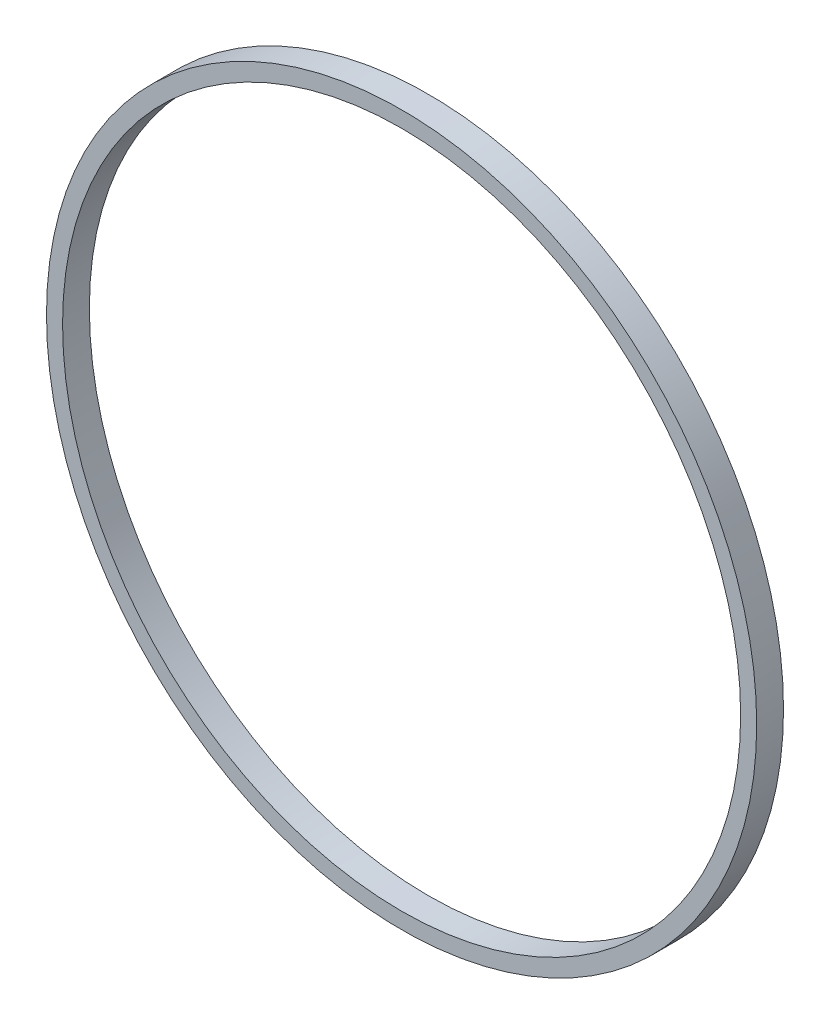
ISO-10303-21;
HEADER;
FILE_DESCRIPTION(('STEP AP214'),'2;1');
FILE_NAME('part.step','',(''),(''),'','','');
FILE_SCHEMA(('AUTOMOTIVE_DESIGN { 1 0 10303 214 1 1 1 1 }'));
ENDSEC;
DATA;
#1=APPLICATION_CONTEXT('core data for automotive mechanical design processes');
#2=APPLICATION_PROTOCOL_DEFINITION('international standard','automotive_design',2000,#1);
#3=PRODUCT_CONTEXT('',#1,'mechanical');
#4=PRODUCT('Part','Part','',(#3));
#5=PRODUCT_RELATED_PRODUCT_CATEGORY('part','',(#4));
#6=PRODUCT_DEFINITION_FORMATION('','',#4);
#7=PRODUCT_DEFINITION_CONTEXT('part definition',#1,'design');
#8=PRODUCT_DEFINITION('design','',#6,#7);
#9=PRODUCT_DEFINITION_SHAPE('','',#8);
#10=(LENGTH_UNIT() NAMED_UNIT(*) SI_UNIT(.MILLI.,.METRE.));
#11=(NAMED_UNIT(*) PLANE_ANGLE_UNIT() SI_UNIT($,.RADIAN.));
#12=(NAMED_UNIT(*) SI_UNIT($,.STERADIAN.) SOLID_ANGLE_UNIT());
#13=UNCERTAINTY_MEASURE_WITH_UNIT(LENGTH_MEASURE(1.E-05),#10,'distance_accuracy_value','');
#14=(GEOMETRIC_REPRESENTATION_CONTEXT(3) GLOBAL_UNCERTAINTY_ASSIGNED_CONTEXT((#13)) GLOBAL_UNIT_ASSIGNED_CONTEXT((#10,
#11,#12)) REPRESENTATION_CONTEXT('',''));
#15=CARTESIAN_POINT('',(0.,0.,0.));
#16=DIRECTION('',(0.,0.,1.));
#17=DIRECTION('',(1.,0.,0.));
#18=AXIS2_PLACEMENT_3D('',#15,#16,#17);
#19=CARTESIAN_POINT('',(0.,0.,5.));
#20=DIRECTION('',(0.,0.,1.));
#21=DIRECTION('',(1.,0.,0.));
#22=AXIS2_PLACEMENT_3D('',#19,#20,#21);
#23=PLANE('',#22);
#24=CARTESIAN_POINT('',(0.,0.,5.));
#25=DIRECTION('',(0.,0.,1.));
#26=DIRECTION('',(1.,0.,0.));
#27=AXIS2_PLACEMENT_3D('',#24,#25,#26);
#28=CIRCLE('',#27,66.25);
#29=CARTESIAN_POINT('',(66.25,0.,5.));
#30=VERTEX_POINT('',#29);
#31=EDGE_CURVE('E10',#30,#30,#28,.T.);
#32=ORIENTED_EDGE('',*,*,#31,.T.);
#33=EDGE_LOOP('',(#32));
#34=FACE_BOUND('',#33,.T.);
#35=CARTESIAN_POINT('',(0.,0.,5.));
#36=DIRECTION('',(0.,0.,1.));
#37=DIRECTION('',(1.,0.,0.));
#38=AXIS2_PLACEMENT_3D('',#35,#36,#37);
#39=CIRCLE('',#38,63.25);
#40=CARTESIAN_POINT('',(63.25,0.,5.));
#41=VERTEX_POINT('',#40);
#42=EDGE_CURVE('E42',#41,#41,#39,.T.);
#43=ORIENTED_EDGE('',*,*,#42,.F.);
#44=EDGE_LOOP('',(#43));
#45=FACE_BOUND('',#44,.T.);
#46=ADVANCED_FACE('F31',(#34,#45),#23,.T.);
#47=CARTESIAN_POINT('',(0.,0.,0.));
#48=DIRECTION('',(0.,0.,1.));
#49=DIRECTION('',(1.,0.,0.));
#50=AXIS2_PLACEMENT_3D('',#47,#48,#49);
#51=PLANE('',#50);
#52=CARTESIAN_POINT('',(0.,0.,0.));
#53=DIRECTION('',(0.,0.,1.));
#54=DIRECTION('',(1.,0.,0.));
#55=AXIS2_PLACEMENT_3D('',#52,#53,#54);
#56=CIRCLE('',#55,66.25);
#57=CARTESIAN_POINT('',(66.25,0.,0.));
#58=VERTEX_POINT('',#57);
#59=EDGE_CURVE('E35',#58,#58,#56,.T.);
#60=ORIENTED_EDGE('',*,*,#59,.F.);
#61=EDGE_LOOP('',(#60));
#62=FACE_BOUND('',#61,.T.);
#63=CARTESIAN_POINT('',(0.,0.,0.));
#64=DIRECTION('',(0.,0.,1.));
#65=DIRECTION('',(1.,0.,0.));
#66=AXIS2_PLACEMENT_3D('',#63,#64,#65);
#67=CIRCLE('',#66,63.25);
#68=CARTESIAN_POINT('',(63.25,0.,0.));
#69=VERTEX_POINT('',#68);
#70=EDGE_CURVE('E44',#69,#69,#67,.T.);
#71=ORIENTED_EDGE('',*,*,#70,.T.);
#72=EDGE_LOOP('',(#71));
#73=FACE_BOUND('',#72,.T.);
#74=ADVANCED_FACE('F54',(#62,#73),#51,.F.);
#75=CARTESIAN_POINT('',(0.,0.,5.));
#76=DIRECTION('',(0.,0.,-1.));
#77=DIRECTION('',(-1.,0.,0.));
#78=AXIS2_PLACEMENT_3D('',#75,#76,#77);
#79=CYLINDRICAL_SURFACE('',#78,66.25);
#80=ORIENTED_EDGE('',*,*,#31,.F.);
#81=EDGE_LOOP('',(#80));
#82=FACE_BOUND('',#81,.T.);
#83=ORIENTED_EDGE('',*,*,#59,.T.);
#84=EDGE_LOOP('',(#83));
#85=FACE_BOUND('',#84,.T.);
#86=ADVANCED_FACE('F33',(#82,#85),#79,.T.);
#87=CARTESIAN_POINT('',(0.,0.,5.));
#88=DIRECTION('',(0.,0.,-1.));
#89=DIRECTION('',(-1.,0.,0.));
#90=AXIS2_PLACEMENT_3D('',#87,#88,#89);
#91=CYLINDRICAL_SURFACE('',#90,63.25);
#92=ORIENTED_EDGE('',*,*,#42,.T.);
#93=EDGE_LOOP('',(#92));
#94=FACE_BOUND('',#93,.T.);
#95=ORIENTED_EDGE('',*,*,#70,.F.);
#96=EDGE_LOOP('',(#95));
#97=FACE_BOUND('',#96,.T.);
#98=ADVANCED_FACE('F50',(#94,#97),#91,.F.);
#99=CLOSED_SHELL('',(#46,#74,#86,#98));
#100=MANIFOLD_SOLID_BREP('B2',#99);
#101=ADVANCED_BREP_SHAPE_REPRESENTATION('',(#18,#100),#14);
#102=SHAPE_DEFINITION_REPRESENTATION(#9,#101);
ENDSEC;
END-ISO-10303-21;
